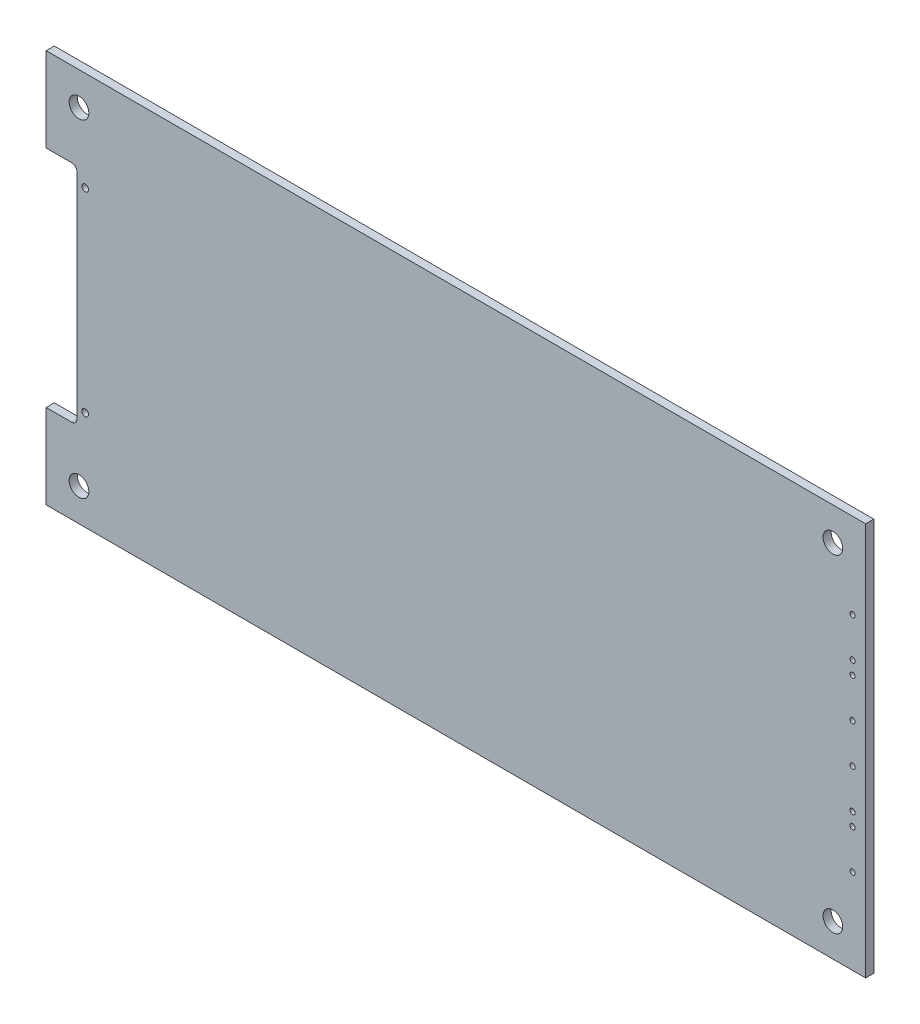
ISO-10303-21;
HEADER;
FILE_DESCRIPTION(('STEP AP214'),'2;1');
FILE_NAME('part.step','',(''),(''),'','','');
FILE_SCHEMA(('AUTOMOTIVE_DESIGN { 1 0 10303 214 1 1 1 1 }'));
ENDSEC;
DATA;
#1=APPLICATION_CONTEXT('core data for automotive mechanical design processes');
#2=APPLICATION_PROTOCOL_DEFINITION('international standard','automotive_design',2000,#1);
#3=PRODUCT_CONTEXT('',#1,'mechanical');
#4=PRODUCT('Part','Part','',(#3));
#5=PRODUCT_RELATED_PRODUCT_CATEGORY('part','',(#4));
#6=PRODUCT_DEFINITION_FORMATION('','',#4);
#7=PRODUCT_DEFINITION_CONTEXT('part definition',#1,'design');
#8=PRODUCT_DEFINITION('design','',#6,#7);
#9=PRODUCT_DEFINITION_SHAPE('','',#8);
#10=(LENGTH_UNIT() NAMED_UNIT(*) SI_UNIT(.MILLI.,.METRE.));
#11=(NAMED_UNIT(*) PLANE_ANGLE_UNIT() SI_UNIT($,.RADIAN.));
#12=(NAMED_UNIT(*) SI_UNIT($,.STERADIAN.) SOLID_ANGLE_UNIT());
#13=UNCERTAINTY_MEASURE_WITH_UNIT(LENGTH_MEASURE(1.E-05),#10,'distance_accuracy_value','');
#14=(GEOMETRIC_REPRESENTATION_CONTEXT(3) GLOBAL_UNCERTAINTY_ASSIGNED_CONTEXT((#13)) GLOBAL_UNIT_ASSIGNED_CONTEXT((#10,
#11,#12)) REPRESENTATION_CONTEXT('',''));
#15=CARTESIAN_POINT('',(0.,0.,0.));
#16=DIRECTION('',(0.,0.,1.));
#17=DIRECTION('',(1.,0.,0.));
#18=AXIS2_PLACEMENT_3D('',#15,#16,#17);
#19=CARTESIAN_POINT('',(0.,0.,1.5748));
#20=DIRECTION('',(1.,0.,0.));
#21=DIRECTION('',(0.,1.,0.));
#22=AXIS2_PLACEMENT_3D('',#19,#20,#21);
#23=PLANE('',#22);
#24=DIRECTION('',(0.,-1.,0.));
#25=VECTOR('',#24,1.);
#26=CARTESIAN_POINT('',(0.,0.,0.));
#27=LINE('',#26,#25);
#28=CARTESIAN_POINT('',(0.,0.,0.));
#29=VERTEX_POINT('',#28);
#30=CARTESIAN_POINT('',(0.,-16.335006,0.));
#31=VERTEX_POINT('',#30);
#32=EDGE_CURVE('E243',#29,#31,#27,.T.);
#33=ORIENTED_EDGE('',*,*,#32,.T.);
#34=DIRECTION('',(0.,0.,1.));
#35=VECTOR('',#34,1.);
#36=CARTESIAN_POINT('',(0.,-16.335006,0.));
#37=LINE('',#36,#35);
#38=CARTESIAN_POINT('',(0.,-16.335006,1.5748));
#39=VERTEX_POINT('',#38);
#40=EDGE_CURVE('E191',#31,#39,#37,.T.);
#41=ORIENTED_EDGE('',*,*,#40,.T.);
#42=DIRECTION('',(0.,-1.,0.));
#43=VECTOR('',#42,1.);
#44=CARTESIAN_POINT('',(0.,0.,1.5748));
#45=LINE('',#44,#43);
#46=CARTESIAN_POINT('',(0.,0.,1.5748));
#47=VERTEX_POINT('',#46);
#48=EDGE_CURVE('E133',#47,#39,#45,.T.);
#49=ORIENTED_EDGE('',*,*,#48,.F.);
#50=DIRECTION('',(0.,0.,-1.));
#51=VECTOR('',#50,1.);
#52=CARTESIAN_POINT('',(0.,0.,1.5748));
#53=LINE('',#52,#51);
#54=EDGE_CURVE('E36',#47,#29,#53,.T.);
#55=ORIENTED_EDGE('',*,*,#54,.T.);
#56=EDGE_LOOP('',(#33,#41,#49,#55));
#57=FACE_BOUND('',#56,.T.);
#58=ADVANCED_FACE('F27',(#57),#23,.F.);
#59=CARTESIAN_POINT('',(158.75,0.,1.5748));
#60=DIRECTION('',(-1.,0.,0.));
#61=DIRECTION('',(0.,0.,1.));
#62=AXIS2_PLACEMENT_3D('',#59,#60,#61);
#63=PLANE('',#62);
#64=DIRECTION('',(0.,1.,0.));
#65=VECTOR('',#64,1.);
#66=CARTESIAN_POINT('',(158.75,0.,0.));
#67=LINE('',#66,#65);
#68=CARTESIAN_POINT('',(158.75,-76.2,0.));
#69=VERTEX_POINT('',#68);
#70=CARTESIAN_POINT('',(158.75,0.,0.));
#71=VERTEX_POINT('',#70);
#72=EDGE_CURVE('E237',#69,#71,#67,.T.);
#73=ORIENTED_EDGE('',*,*,#72,.T.);
#74=DIRECTION('',(0.,0.,-1.));
#75=VECTOR('',#74,1.);
#76=CARTESIAN_POINT('',(158.75,0.,1.5748));
#77=LINE('',#76,#75);
#78=CARTESIAN_POINT('',(158.75,0.,1.5748));
#79=VERTEX_POINT('',#78);
#80=EDGE_CURVE('E11',#79,#71,#77,.T.);
#81=ORIENTED_EDGE('',*,*,#80,.F.);
#82=DIRECTION('',(0.,1.,0.));
#83=VECTOR('',#82,1.);
#84=CARTESIAN_POINT('',(158.75,0.,1.5748));
#85=LINE('',#84,#83);
#86=CARTESIAN_POINT('',(158.75,-76.2,1.5748));
#87=VERTEX_POINT('',#86);
#88=EDGE_CURVE('E137',#87,#79,#85,.T.);
#89=ORIENTED_EDGE('',*,*,#88,.F.);
#90=DIRECTION('',(0.,0.,-1.));
#91=VECTOR('',#90,1.);
#92=CARTESIAN_POINT('',(158.75,-76.2,1.5748));
#93=LINE('',#92,#91);
#94=EDGE_CURVE('E142',#87,#69,#93,.T.);
#95=ORIENTED_EDGE('',*,*,#94,.T.);
#96=EDGE_LOOP('',(#73,#81,#89,#95));
#97=FACE_BOUND('',#96,.T.);
#98=ADVANCED_FACE('F29',(#97),#63,.F.);
#99=CARTESIAN_POINT('',(0.,0.,1.5748));
#100=DIRECTION('',(0.,-1.,0.));
#101=DIRECTION('',(0.,0.,-1.));
#102=AXIS2_PLACEMENT_3D('',#99,#100,#101);
#103=PLANE('',#102);
#104=DIRECTION('',(-1.,0.,0.));
#105=VECTOR('',#104,1.);
#106=CARTESIAN_POINT('',(0.,0.,0.));
#107=LINE('',#106,#105);
#108=EDGE_CURVE('E240',#71,#29,#107,.T.);
#109=ORIENTED_EDGE('',*,*,#108,.T.);
#110=ORIENTED_EDGE('',*,*,#54,.F.);
#111=DIRECTION('',(-1.,0.,0.));
#112=VECTOR('',#111,1.);
#113=CARTESIAN_POINT('',(0.,0.,1.5748));
#114=LINE('',#113,#112);
#115=EDGE_CURVE('E134',#79,#47,#114,.T.);
#116=ORIENTED_EDGE('',*,*,#115,.F.);
#117=ORIENTED_EDGE('',*,*,#80,.T.);
#118=EDGE_LOOP('',(#109,#110,#116,#117));
#119=FACE_BOUND('',#118,.T.);
#120=ADVANCED_FACE('F253',(#119),#103,.F.);
#121=CARTESIAN_POINT('',(0.,-59.865006,1.5748));
#122=VERTEX_POINT('',#121);
#123=CARTESIAN_POINT('',(0.,-76.2,1.5748));
#124=VERTEX_POINT('',#123);
#125=EDGE_CURVE('E123',#122,#124,#45,.T.);
#126=ORIENTED_EDGE('',*,*,#125,.F.);
#127=DIRECTION('',(0.,0.,1.));
#128=VECTOR('',#127,1.);
#129=CARTESIAN_POINT('',(0.,-59.865006,0.));
#130=LINE('',#129,#128);
#131=CARTESIAN_POINT('',(0.,-59.865006,0.));
#132=VERTEX_POINT('',#131);
#133=EDGE_CURVE('E107',#132,#122,#130,.T.);
#134=ORIENTED_EDGE('',*,*,#133,.F.);
#135=CARTESIAN_POINT('',(0.,-76.2,0.));
#136=VERTEX_POINT('',#135);
#137=EDGE_CURVE('E242',#132,#136,#27,.T.);
#138=ORIENTED_EDGE('',*,*,#137,.T.);
#139=DIRECTION('',(0.,0.,-1.));
#140=VECTOR('',#139,1.);
#141=CARTESIAN_POINT('',(0.,-76.2,1.5748));
#142=LINE('',#141,#140);
#143=EDGE_CURVE('E132',#124,#136,#142,.T.);
#144=ORIENTED_EDGE('',*,*,#143,.F.);
#145=EDGE_LOOP('',(#126,#134,#138,#144));
#146=FACE_BOUND('',#145,.T.);
#147=ADVANCED_FACE('F130',(#146),#23,.F.);
#148=CARTESIAN_POINT('',(0.,-76.2,1.5748));
#149=DIRECTION('',(0.,1.,0.));
#150=DIRECTION('',(0.,0.,1.));
#151=AXIS2_PLACEMENT_3D('',#148,#149,#150);
#152=PLANE('',#151);
#153=DIRECTION('',(1.,0.,0.));
#154=VECTOR('',#153,1.);
#155=CARTESIAN_POINT('',(0.,-76.2,0.));
#156=LINE('',#155,#154);
#157=EDGE_CURVE('E246',#136,#69,#156,.T.);
#158=ORIENTED_EDGE('',*,*,#157,.T.);
#159=ORIENTED_EDGE('',*,*,#94,.F.);
#160=DIRECTION('',(1.,0.,0.));
#161=VECTOR('',#160,1.);
#162=CARTESIAN_POINT('',(0.,-76.2,1.5748));
#163=LINE('',#162,#161);
#164=EDGE_CURVE('E52',#124,#87,#163,.T.);
#165=ORIENTED_EDGE('',*,*,#164,.F.);
#166=ORIENTED_EDGE('',*,*,#143,.T.);
#167=EDGE_LOOP('',(#158,#159,#165,#166));
#168=FACE_BOUND('',#167,.T.);
#169=ADVANCED_FACE('F272',(#168),#152,.F.);
#170=CARTESIAN_POINT('',(158.75,-76.2,1.5748));
#171=DIRECTION('',(0.,0.,1.));
#172=DIRECTION('',(1.,0.,0.));
#173=AXIS2_PLACEMENT_3D('',#170,#171,#172);
#174=PLANE('',#173);
#175=CARTESIAN_POINT('',(156.21,-24.13,1.5748));
#176=DIRECTION('',(0.,0.,1.));
#177=DIRECTION('',(1.,0.,0.));
#178=AXIS2_PLACEMENT_3D('',#175,#176,#177);
#179=CIRCLE('',#178,0.508000000000003);
#180=CARTESIAN_POINT('',(156.718,-24.13,1.5748));
#181=VERTEX_POINT('',#180);
#182=EDGE_CURVE('E458',#181,#181,#179,.T.);
#183=ORIENTED_EDGE('',*,*,#182,.F.);
#184=EDGE_LOOP('',(#183));
#185=FACE_BOUND('',#184,.T.);
#186=CARTESIAN_POINT('',(156.21,-26.67,1.5748));
#187=DIRECTION('',(0.,0.,1.));
#188=DIRECTION('',(1.,0.,0.));
#189=AXIS2_PLACEMENT_3D('',#186,#187,#188);
#190=CIRCLE('',#189,0.508000000000003);
#191=CARTESIAN_POINT('',(156.718,-26.67,1.5748));
#192=VERTEX_POINT('',#191);
#193=EDGE_CURVE('E462',#192,#192,#190,.T.);
#194=ORIENTED_EDGE('',*,*,#193,.F.);
#195=EDGE_LOOP('',(#194));
#196=FACE_BOUND('',#195,.T.);
#197=CARTESIAN_POINT('',(156.21,-34.29,1.5748));
#198=DIRECTION('',(0.,0.,1.));
#199=DIRECTION('',(1.,0.,0.));
#200=AXIS2_PLACEMENT_3D('',#197,#198,#199);
#201=CIRCLE('',#200,0.508000000000003);
#202=CARTESIAN_POINT('',(156.718,-34.29,1.5748));
#203=VERTEX_POINT('',#202);
#204=EDGE_CURVE('E471',#203,#203,#201,.T.);
#205=ORIENTED_EDGE('',*,*,#204,.F.);
#206=EDGE_LOOP('',(#205));
#207=FACE_BOUND('',#206,.T.);
#208=CARTESIAN_POINT('',(156.21,-16.51,1.5748));
#209=DIRECTION('',(0.,0.,1.));
#210=DIRECTION('',(1.,0.,0.));
#211=AXIS2_PLACEMENT_3D('',#208,#209,#210);
#212=CIRCLE('',#211,0.508000000000003);
#213=CARTESIAN_POINT('',(156.718,-16.51,1.5748));
#214=VERTEX_POINT('',#213);
#215=EDGE_CURVE('E477',#214,#214,#212,.T.);
#216=ORIENTED_EDGE('',*,*,#215,.F.);
#217=EDGE_LOOP('',(#216));
#218=FACE_BOUND('',#217,.T.);
#219=CARTESIAN_POINT('',(156.21,-41.91,1.5748));
#220=DIRECTION('',(0.,0.,1.));
#221=DIRECTION('',(1.,0.,0.));
#222=AXIS2_PLACEMENT_3D('',#219,#220,#221);
#223=CIRCLE('',#222,0.508000000000003);
#224=CARTESIAN_POINT('',(156.718,-41.91,1.5748));
#225=VERTEX_POINT('',#224);
#226=EDGE_CURVE('E166',#225,#225,#223,.T.);
#227=ORIENTED_EDGE('',*,*,#226,.F.);
#228=EDGE_LOOP('',(#227));
#229=FACE_BOUND('',#228,.T.);
#230=CARTESIAN_POINT('',(156.21,-49.53,1.5748));
#231=DIRECTION('',(0.,0.,1.));
#232=DIRECTION('',(1.,0.,0.));
#233=AXIS2_PLACEMENT_3D('',#230,#231,#232);
#234=CIRCLE('',#233,0.508000000000003);
#235=CARTESIAN_POINT('',(156.718,-49.53,1.5748));
#236=VERTEX_POINT('',#235);
#237=EDGE_CURVE('E156',#236,#236,#234,.T.);
#238=ORIENTED_EDGE('',*,*,#237,.F.);
#239=EDGE_LOOP('',(#238));
#240=FACE_BOUND('',#239,.T.);
#241=CARTESIAN_POINT('',(156.21,-52.07,1.5748));
#242=DIRECTION('',(0.,0.,1.));
#243=DIRECTION('',(1.,0.,0.));
#244=AXIS2_PLACEMENT_3D('',#241,#242,#243);
#245=CIRCLE('',#244,0.508000000000003);
#246=CARTESIAN_POINT('',(156.718,-52.07,1.5748));
#247=VERTEX_POINT('',#246);
#248=EDGE_CURVE('E153',#247,#247,#245,.T.);
#249=ORIENTED_EDGE('',*,*,#248,.F.);
#250=EDGE_LOOP('',(#249));
#251=FACE_BOUND('',#250,.T.);
#252=CARTESIAN_POINT('',(156.21,-59.69,1.5748));
#253=DIRECTION('',(0.,0.,1.));
#254=DIRECTION('',(1.,0.,0.));
#255=AXIS2_PLACEMENT_3D('',#252,#253,#254);
#256=CIRCLE('',#255,0.508000000000003);
#257=CARTESIAN_POINT('',(156.718,-59.69,1.5748));
#258=VERTEX_POINT('',#257);
#259=EDGE_CURVE('E150',#258,#258,#256,.T.);
#260=ORIENTED_EDGE('',*,*,#259,.F.);
#261=EDGE_LOOP('',(#260));
#262=FACE_BOUND('',#261,.T.);
#263=DIRECTION('',(-1.,0.,0.));
#264=VECTOR('',#263,1.);
#265=CARTESIAN_POINT('',(0.,-16.335006,1.5748));
#266=LINE('',#265,#264);
#267=CARTESIAN_POINT('',(4.95,-16.335006,1.5748));
#268=VERTEX_POINT('',#267);
#269=EDGE_CURVE('E179',#268,#39,#266,.T.);
#270=ORIENTED_EDGE('',*,*,#269,.F.);
#271=CARTESIAN_POINT('',(4.95,-17.335006,1.5748));
#272=DIRECTION('',(0.,0.,1.));
#273=DIRECTION('',(-1.,0.,0.));
#274=AXIS2_PLACEMENT_3D('',#271,#272,#273);
#275=CIRCLE('',#274,1.);
#276=CARTESIAN_POINT('',(5.95000000000001,-17.335006,1.5748));
#277=VERTEX_POINT('',#276);
#278=EDGE_CURVE('E176',#277,#268,#275,.T.);
#279=ORIENTED_EDGE('',*,*,#278,.F.);
#280=DIRECTION('',(0.,1.,0.));
#281=VECTOR('',#280,1.);
#282=CARTESIAN_POINT('',(5.95,-58.865006,1.5748));
#283=LINE('',#282,#281);
#284=CARTESIAN_POINT('',(5.95,-58.865006,1.5748));
#285=VERTEX_POINT('',#284);
#286=EDGE_CURVE('E173',#285,#277,#283,.T.);
#287=ORIENTED_EDGE('',*,*,#286,.F.);
#288=CARTESIAN_POINT('',(4.95,-58.865006,1.5748));
#289=DIRECTION('',(0.,0.,1.));
#290=DIRECTION('',(-1.,0.,0.));
#291=AXIS2_PLACEMENT_3D('',#288,#289,#290);
#292=CIRCLE('',#291,1.);
#293=CARTESIAN_POINT('',(4.95,-59.865006,1.5748));
#294=VERTEX_POINT('',#293);
#295=EDGE_CURVE('E127',#294,#285,#292,.T.);
#296=ORIENTED_EDGE('',*,*,#295,.F.);
#297=DIRECTION('',(1.,0.,0.));
#298=VECTOR('',#297,1.);
#299=CARTESIAN_POINT('',(0.,-59.865006,1.5748));
#300=LINE('',#299,#298);
#301=EDGE_CURVE('E110',#122,#294,#300,.T.);
#302=ORIENTED_EDGE('',*,*,#301,.F.);
#303=ORIENTED_EDGE('',*,*,#125,.T.);
#304=ORIENTED_EDGE('',*,*,#164,.T.);
#305=ORIENTED_EDGE('',*,*,#88,.T.);
#306=ORIENTED_EDGE('',*,*,#115,.T.);
#307=ORIENTED_EDGE('',*,*,#48,.T.);
#308=EDGE_LOOP('',(#270,#279,#287,#296,#302,#303,#304,#305,#306,#307));
#309=FACE_BOUND('',#308,.T.);
#310=CARTESIAN_POINT('',(7.55,-56.965088,1.5748));
#311=DIRECTION('',(0.,0.,1.));
#312=DIRECTION('',(1.,0.,0.));
#313=AXIS2_PLACEMENT_3D('',#310,#311,#312);
#314=CIRCLE('',#313,0.649999999999997);
#315=CARTESIAN_POINT('',(8.2,-56.965088,1.5748));
#316=VERTEX_POINT('',#315);
#317=EDGE_CURVE('E194',#316,#316,#314,.T.);
#318=ORIENTED_EDGE('',*,*,#317,.F.);
#319=EDGE_LOOP('',(#318));
#320=FACE_BOUND('',#319,.T.);
#321=CARTESIAN_POINT('',(7.55,-19.234912,1.5748));
#322=DIRECTION('',(0.,0.,1.));
#323=DIRECTION('',(1.,0.,0.));
#324=AXIS2_PLACEMENT_3D('',#321,#322,#323);
#325=CIRCLE('',#324,0.649999999999999);
#326=CARTESIAN_POINT('',(8.2,-19.234912,1.5748));
#327=VERTEX_POINT('',#326);
#328=EDGE_CURVE('E207',#327,#327,#325,.T.);
#329=ORIENTED_EDGE('',*,*,#328,.F.);
#330=EDGE_LOOP('',(#329));
#331=FACE_BOUND('',#330,.T.);
#332=CARTESIAN_POINT('',(6.35,-69.85,1.5748));
#333=DIRECTION('',(0.,0.,1.));
#334=DIRECTION('',(1.,0.,0.));
#335=AXIS2_PLACEMENT_3D('',#332,#333,#334);
#336=CIRCLE('',#335,1.905);
#337=CARTESIAN_POINT('',(8.255,-69.85,1.5748));
#338=VERTEX_POINT('',#337);
#339=EDGE_CURVE('E213',#338,#338,#336,.T.);
#340=ORIENTED_EDGE('',*,*,#339,.F.);
#341=EDGE_LOOP('',(#340));
#342=FACE_BOUND('',#341,.T.);
#343=CARTESIAN_POINT('',(152.4,-69.85,1.5748));
#344=DIRECTION('',(0.,0.,1.));
#345=DIRECTION('',(1.,0.,0.));
#346=AXIS2_PLACEMENT_3D('',#343,#344,#345);
#347=CIRCLE('',#346,1.90499999999999);
#348=CARTESIAN_POINT('',(154.305,-69.85,1.5748));
#349=VERTEX_POINT('',#348);
#350=EDGE_CURVE('E219',#349,#349,#347,.T.);
#351=ORIENTED_EDGE('',*,*,#350,.F.);
#352=EDGE_LOOP('',(#351));
#353=FACE_BOUND('',#352,.T.);
#354=CARTESIAN_POINT('',(6.34999999999999,-6.35,1.5748));
#355=DIRECTION('',(0.,0.,1.));
#356=DIRECTION('',(1.,0.,0.));
#357=AXIS2_PLACEMENT_3D('',#354,#355,#356);
#358=CIRCLE('',#357,1.905);
#359=CARTESIAN_POINT('',(8.255,-6.35,1.5748));
#360=VERTEX_POINT('',#359);
#361=EDGE_CURVE('E225',#360,#360,#358,.T.);
#362=ORIENTED_EDGE('',*,*,#361,.F.);
#363=EDGE_LOOP('',(#362));
#364=FACE_BOUND('',#363,.T.);
#365=CARTESIAN_POINT('',(152.4,-6.34999999999999,1.5748));
#366=DIRECTION('',(0.,0.,1.));
#367=DIRECTION('',(1.,0.,0.));
#368=AXIS2_PLACEMENT_3D('',#365,#366,#367);
#369=CIRCLE('',#368,1.90499999999999);
#370=CARTESIAN_POINT('',(154.305,-6.34999999999999,1.5748));
#371=VERTEX_POINT('',#370);
#372=EDGE_CURVE('E231',#371,#371,#369,.T.);
#373=ORIENTED_EDGE('',*,*,#372,.F.);
#374=EDGE_LOOP('',(#373));
#375=FACE_BOUND('',#374,.T.);
#376=ADVANCED_FACE('F121',(#185,#196,#207,#218,#229,#240,#251,#262,#309,#320,#331,#342,#353,
#364,#375),#174,.T.);
#377=CARTESIAN_POINT('',(158.75,-76.2,0.));
#378=DIRECTION('',(0.,0.,1.));
#379=DIRECTION('',(1.,0.,0.));
#380=AXIS2_PLACEMENT_3D('',#377,#378,#379);
#381=PLANE('',#380);
#382=CARTESIAN_POINT('',(156.21,-24.13,0.));
#383=DIRECTION('',(0.,0.,1.));
#384=DIRECTION('',(1.,0.,0.));
#385=AXIS2_PLACEMENT_3D('',#382,#383,#384);
#386=CIRCLE('',#385,0.508000000000003);
#387=CARTESIAN_POINT('',(156.718,-24.13,0.));
#388=VERTEX_POINT('',#387);
#389=EDGE_CURVE('E461',#388,#388,#386,.T.);
#390=ORIENTED_EDGE('',*,*,#389,.T.);
#391=EDGE_LOOP('',(#390));
#392=FACE_BOUND('',#391,.T.);
#393=CARTESIAN_POINT('',(156.21,-26.67,0.));
#394=DIRECTION('',(0.,0.,1.));
#395=DIRECTION('',(1.,0.,0.));
#396=AXIS2_PLACEMENT_3D('',#393,#394,#395);
#397=CIRCLE('',#396,0.508000000000003);
#398=CARTESIAN_POINT('',(156.718,-26.67,0.));
#399=VERTEX_POINT('',#398);
#400=EDGE_CURVE('E465',#399,#399,#397,.T.);
#401=ORIENTED_EDGE('',*,*,#400,.T.);
#402=EDGE_LOOP('',(#401));
#403=FACE_BOUND('',#402,.T.);
#404=CARTESIAN_POINT('',(156.21,-34.29,0.));
#405=DIRECTION('',(0.,0.,1.));
#406=DIRECTION('',(1.,0.,0.));
#407=AXIS2_PLACEMENT_3D('',#404,#405,#406);
#408=CIRCLE('',#407,0.508000000000003);
#409=CARTESIAN_POINT('',(156.718,-34.29,0.));
#410=VERTEX_POINT('',#409);
#411=EDGE_CURVE('E474',#410,#410,#408,.T.);
#412=ORIENTED_EDGE('',*,*,#411,.T.);
#413=EDGE_LOOP('',(#412));
#414=FACE_BOUND('',#413,.T.);
#415=CARTESIAN_POINT('',(156.21,-16.51,0.));
#416=DIRECTION('',(0.,0.,1.));
#417=DIRECTION('',(1.,0.,0.));
#418=AXIS2_PLACEMENT_3D('',#415,#416,#417);
#419=CIRCLE('',#418,0.508000000000003);
#420=CARTESIAN_POINT('',(156.718,-16.51,0.));
#421=VERTEX_POINT('',#420);
#422=EDGE_CURVE('E479',#421,#421,#419,.T.);
#423=ORIENTED_EDGE('',*,*,#422,.T.);
#424=EDGE_LOOP('',(#423));
#425=FACE_BOUND('',#424,.T.);
#426=CARTESIAN_POINT('',(156.21,-41.91,0.));
#427=DIRECTION('',(0.,0.,1.));
#428=DIRECTION('',(1.,0.,0.));
#429=AXIS2_PLACEMENT_3D('',#426,#427,#428);
#430=CIRCLE('',#429,0.508000000000003);
#431=CARTESIAN_POINT('',(156.718,-41.91,0.));
#432=VERTEX_POINT('',#431);
#433=EDGE_CURVE('E31',#432,#432,#430,.T.);
#434=ORIENTED_EDGE('',*,*,#433,.T.);
#435=EDGE_LOOP('',(#434));
#436=FACE_BOUND('',#435,.T.);
#437=CARTESIAN_POINT('',(156.21,-49.53,0.));
#438=DIRECTION('',(0.,0.,1.));
#439=DIRECTION('',(1.,0.,0.));
#440=AXIS2_PLACEMENT_3D('',#437,#438,#439);
#441=CIRCLE('',#440,0.508000000000003);
#442=CARTESIAN_POINT('',(156.718,-49.53,0.));
#443=VERTEX_POINT('',#442);
#444=EDGE_CURVE('E154',#443,#443,#441,.T.);
#445=ORIENTED_EDGE('',*,*,#444,.T.);
#446=EDGE_LOOP('',(#445));
#447=FACE_BOUND('',#446,.T.);
#448=CARTESIAN_POINT('',(156.21,-52.07,0.));
#449=DIRECTION('',(0.,0.,1.));
#450=DIRECTION('',(1.,0.,0.));
#451=AXIS2_PLACEMENT_3D('',#448,#449,#450);
#452=CIRCLE('',#451,0.508000000000003);
#453=CARTESIAN_POINT('',(156.718,-52.07,0.));
#454=VERTEX_POINT('',#453);
#455=EDGE_CURVE('E151',#454,#454,#452,.T.);
#456=ORIENTED_EDGE('',*,*,#455,.T.);
#457=EDGE_LOOP('',(#456));
#458=FACE_BOUND('',#457,.T.);
#459=CARTESIAN_POINT('',(156.21,-59.69,0.));
#460=DIRECTION('',(0.,0.,1.));
#461=DIRECTION('',(1.,0.,0.));
#462=AXIS2_PLACEMENT_3D('',#459,#460,#461);
#463=CIRCLE('',#462,0.508000000000003);
#464=CARTESIAN_POINT('',(156.718,-59.69,0.));
#465=VERTEX_POINT('',#464);
#466=EDGE_CURVE('E128',#465,#465,#463,.T.);
#467=ORIENTED_EDGE('',*,*,#466,.T.);
#468=EDGE_LOOP('',(#467));
#469=FACE_BOUND('',#468,.T.);
#470=CARTESIAN_POINT('',(7.55,-56.965088,0.));
#471=DIRECTION('',(0.,0.,1.));
#472=DIRECTION('',(1.,0.,0.));
#473=AXIS2_PLACEMENT_3D('',#470,#471,#472);
#474=CIRCLE('',#473,0.649999999999997);
#475=CARTESIAN_POINT('',(8.2,-56.965088,0.));
#476=VERTEX_POINT('',#475);
#477=EDGE_CURVE('E204',#476,#476,#474,.T.);
#478=ORIENTED_EDGE('',*,*,#477,.T.);
#479=EDGE_LOOP('',(#478));
#480=FACE_BOUND('',#479,.T.);
#481=CARTESIAN_POINT('',(7.55,-19.234912,0.));
#482=DIRECTION('',(0.,0.,1.));
#483=DIRECTION('',(1.,0.,0.));
#484=AXIS2_PLACEMENT_3D('',#481,#482,#483);
#485=CIRCLE('',#484,0.649999999999999);
#486=CARTESIAN_POINT('',(8.2,-19.234912,0.));
#487=VERTEX_POINT('',#486);
#488=EDGE_CURVE('E210',#487,#487,#485,.T.);
#489=ORIENTED_EDGE('',*,*,#488,.T.);
#490=EDGE_LOOP('',(#489));
#491=FACE_BOUND('',#490,.T.);
#492=CARTESIAN_POINT('',(6.35,-69.85,0.));
#493=DIRECTION('',(0.,0.,1.));
#494=DIRECTION('',(1.,0.,0.));
#495=AXIS2_PLACEMENT_3D('',#492,#493,#494);
#496=CIRCLE('',#495,1.905);
#497=CARTESIAN_POINT('',(8.255,-69.85,0.));
#498=VERTEX_POINT('',#497);
#499=EDGE_CURVE('E216',#498,#498,#496,.T.);
#500=ORIENTED_EDGE('',*,*,#499,.T.);
#501=EDGE_LOOP('',(#500));
#502=FACE_BOUND('',#501,.T.);
#503=CARTESIAN_POINT('',(152.4,-69.85,0.));
#504=DIRECTION('',(0.,0.,1.));
#505=DIRECTION('',(1.,0.,0.));
#506=AXIS2_PLACEMENT_3D('',#503,#504,#505);
#507=CIRCLE('',#506,1.90499999999999);
#508=CARTESIAN_POINT('',(154.305,-69.85,0.));
#509=VERTEX_POINT('',#508);
#510=EDGE_CURVE('E222',#509,#509,#507,.T.);
#511=ORIENTED_EDGE('',*,*,#510,.T.);
#512=EDGE_LOOP('',(#511));
#513=FACE_BOUND('',#512,.T.);
#514=CARTESIAN_POINT('',(6.34999999999999,-6.35,0.));
#515=DIRECTION('',(0.,0.,1.));
#516=DIRECTION('',(1.,0.,0.));
#517=AXIS2_PLACEMENT_3D('',#514,#515,#516);
#518=CIRCLE('',#517,1.905);
#519=CARTESIAN_POINT('',(8.255,-6.35,0.));
#520=VERTEX_POINT('',#519);
#521=EDGE_CURVE('E228',#520,#520,#518,.T.);
#522=ORIENTED_EDGE('',*,*,#521,.T.);
#523=EDGE_LOOP('',(#522));
#524=FACE_BOUND('',#523,.T.);
#525=CARTESIAN_POINT('',(152.4,-6.34999999999999,0.));
#526=DIRECTION('',(0.,0.,1.));
#527=DIRECTION('',(1.,0.,0.));
#528=AXIS2_PLACEMENT_3D('',#525,#526,#527);
#529=CIRCLE('',#528,1.90499999999999);
#530=CARTESIAN_POINT('',(154.305,-6.34999999999999,0.));
#531=VERTEX_POINT('',#530);
#532=EDGE_CURVE('E234',#531,#531,#529,.T.);
#533=ORIENTED_EDGE('',*,*,#532,.T.);
#534=EDGE_LOOP('',(#533));
#535=FACE_BOUND('',#534,.T.);
#536=CARTESIAN_POINT('',(4.95,-17.335006,0.));
#537=DIRECTION('',(0.,0.,1.));
#538=DIRECTION('',(-1.,0.,0.));
#539=AXIS2_PLACEMENT_3D('',#536,#537,#538);
#540=CIRCLE('',#539,1.);
#541=CARTESIAN_POINT('',(5.95000000000001,-17.335006,0.));
#542=VERTEX_POINT('',#541);
#543=CARTESIAN_POINT('',(4.95,-16.335006,0.));
#544=VERTEX_POINT('',#543);
#545=EDGE_CURVE('E186',#542,#544,#540,.T.);
#546=ORIENTED_EDGE('',*,*,#545,.T.);
#547=DIRECTION('',(-1.,0.,0.));
#548=VECTOR('',#547,1.);
#549=CARTESIAN_POINT('',(0.,-16.335006,0.));
#550=LINE('',#549,#548);
#551=EDGE_CURVE('E118',#544,#31,#550,.T.);
#552=ORIENTED_EDGE('',*,*,#551,.T.);
#553=ORIENTED_EDGE('',*,*,#32,.F.);
#554=ORIENTED_EDGE('',*,*,#108,.F.);
#555=ORIENTED_EDGE('',*,*,#72,.F.);
#556=ORIENTED_EDGE('',*,*,#157,.F.);
#557=ORIENTED_EDGE('',*,*,#137,.F.);
#558=DIRECTION('',(1.,0.,0.));
#559=VECTOR('',#558,1.);
#560=CARTESIAN_POINT('',(0.,-59.865006,0.));
#561=LINE('',#560,#559);
#562=CARTESIAN_POINT('',(4.95000000000001,-59.865006,0.));
#563=VERTEX_POINT('',#562);
#564=EDGE_CURVE('E113',#132,#563,#561,.T.);
#565=ORIENTED_EDGE('',*,*,#564,.T.);
#566=CARTESIAN_POINT('',(4.95,-58.865006,0.));
#567=DIRECTION('',(0.,0.,1.));
#568=DIRECTION('',(-1.,0.,0.));
#569=AXIS2_PLACEMENT_3D('',#566,#567,#568);
#570=CIRCLE('',#569,1.);
#571=CARTESIAN_POINT('',(5.95,-58.865006,0.));
#572=VERTEX_POINT('',#571);
#573=EDGE_CURVE('E44',#563,#572,#570,.T.);
#574=ORIENTED_EDGE('',*,*,#573,.T.);
#575=DIRECTION('',(0.,1.,0.));
#576=VECTOR('',#575,1.);
#577=CARTESIAN_POINT('',(5.95,-58.865006,0.));
#578=LINE('',#577,#576);
#579=EDGE_CURVE('E183',#572,#542,#578,.T.);
#580=ORIENTED_EDGE('',*,*,#579,.T.);
#581=EDGE_LOOP('',(#546,#552,#553,#554,#555,#556,#557,#565,#574,#580));
#582=FACE_BOUND('',#581,.T.);
#583=ADVANCED_FACE('F269',(#392,#403,#414,#425,#436,#447,#458,#469,#480,#491,#502,#513,#524,
#535,#582),#381,.F.);
#584=CARTESIAN_POINT('',(152.4,-6.34999999999999,0.));
#585=DIRECTION('',(0.,0.,1.));
#586=DIRECTION('',(1.,0.,0.));
#587=AXIS2_PLACEMENT_3D('',#584,#585,#586);
#588=CYLINDRICAL_SURFACE('',#587,1.90499999999999);
#589=ORIENTED_EDGE('',*,*,#532,.F.);
#590=EDGE_LOOP('',(#589));
#591=FACE_BOUND('',#590,.T.);
#592=ORIENTED_EDGE('',*,*,#372,.T.);
#593=EDGE_LOOP('',(#592));
#594=FACE_BOUND('',#593,.T.);
#595=ADVANCED_FACE('F314',(#591,#594),#588,.F.);
#596=CARTESIAN_POINT('',(6.34999999999999,-6.35,0.));
#597=DIRECTION('',(0.,0.,1.));
#598=DIRECTION('',(1.,0.,0.));
#599=AXIS2_PLACEMENT_3D('',#596,#597,#598);
#600=CYLINDRICAL_SURFACE('',#599,1.905);
#601=ORIENTED_EDGE('',*,*,#521,.F.);
#602=EDGE_LOOP('',(#601));
#603=FACE_BOUND('',#602,.T.);
#604=ORIENTED_EDGE('',*,*,#361,.T.);
#605=EDGE_LOOP('',(#604));
#606=FACE_BOUND('',#605,.T.);
#607=ADVANCED_FACE('F322',(#603,#606),#600,.F.);
#608=CARTESIAN_POINT('',(152.4,-69.85,0.));
#609=DIRECTION('',(0.,0.,1.));
#610=DIRECTION('',(1.,0.,0.));
#611=AXIS2_PLACEMENT_3D('',#608,#609,#610);
#612=CYLINDRICAL_SURFACE('',#611,1.90499999999999);
#613=ORIENTED_EDGE('',*,*,#510,.F.);
#614=EDGE_LOOP('',(#613));
#615=FACE_BOUND('',#614,.T.);
#616=ORIENTED_EDGE('',*,*,#350,.T.);
#617=EDGE_LOOP('',(#616));
#618=FACE_BOUND('',#617,.T.);
#619=ADVANCED_FACE('F330',(#615,#618),#612,.F.);
#620=CARTESIAN_POINT('',(6.35,-69.85,0.));
#621=DIRECTION('',(0.,0.,1.));
#622=DIRECTION('',(1.,0.,0.));
#623=AXIS2_PLACEMENT_3D('',#620,#621,#622);
#624=CYLINDRICAL_SURFACE('',#623,1.905);
#625=ORIENTED_EDGE('',*,*,#499,.F.);
#626=EDGE_LOOP('',(#625));
#627=FACE_BOUND('',#626,.T.);
#628=ORIENTED_EDGE('',*,*,#339,.T.);
#629=EDGE_LOOP('',(#628));
#630=FACE_BOUND('',#629,.T.);
#631=ADVANCED_FACE('F338',(#627,#630),#624,.F.);
#632=CARTESIAN_POINT('',(7.55,-19.234912,0.));
#633=DIRECTION('',(0.,0.,1.));
#634=DIRECTION('',(1.,0.,0.));
#635=AXIS2_PLACEMENT_3D('',#632,#633,#634);
#636=CYLINDRICAL_SURFACE('',#635,0.649999999999999);
#637=ORIENTED_EDGE('',*,*,#488,.F.);
#638=EDGE_LOOP('',(#637));
#639=FACE_BOUND('',#638,.T.);
#640=ORIENTED_EDGE('',*,*,#328,.T.);
#641=EDGE_LOOP('',(#640));
#642=FACE_BOUND('',#641,.T.);
#643=ADVANCED_FACE('F344',(#639,#642),#636,.F.);
#644=CARTESIAN_POINT('',(7.55,-56.965088,0.));
#645=DIRECTION('',(0.,0.,1.));
#646=DIRECTION('',(1.,0.,0.));
#647=AXIS2_PLACEMENT_3D('',#644,#645,#646);
#648=CYLINDRICAL_SURFACE('',#647,0.649999999999997);
#649=ORIENTED_EDGE('',*,*,#477,.F.);
#650=EDGE_LOOP('',(#649));
#651=FACE_BOUND('',#650,.T.);
#652=ORIENTED_EDGE('',*,*,#317,.T.);
#653=EDGE_LOOP('',(#652));
#654=FACE_BOUND('',#653,.T.);
#655=ADVANCED_FACE('F354',(#651,#654),#648,.F.);
#656=CARTESIAN_POINT('',(0.,-16.335006,0.));
#657=DIRECTION('',(0.,1.,0.));
#658=DIRECTION('',(0.,0.,1.));
#659=AXIS2_PLACEMENT_3D('',#656,#657,#658);
#660=PLANE('',#659);
#661=ORIENTED_EDGE('',*,*,#269,.T.);
#662=ORIENTED_EDGE('',*,*,#40,.F.);
#663=ORIENTED_EDGE('',*,*,#551,.F.);
#664=DIRECTION('',(0.,0.,1.));
#665=VECTOR('',#664,1.);
#666=CARTESIAN_POINT('',(4.95,-16.335006,0.));
#667=LINE('',#666,#665);
#668=EDGE_CURVE('E195',#544,#268,#667,.T.);
#669=ORIENTED_EDGE('',*,*,#668,.T.);
#670=EDGE_LOOP('',(#661,#662,#663,#669));
#671=FACE_BOUND('',#670,.T.);
#672=ADVANCED_FACE('F259',(#671),#660,.F.);
#673=CARTESIAN_POINT('',(4.95,-17.335006,0.));
#674=DIRECTION('',(0.,0.,1.));
#675=DIRECTION('',(1.,0.,0.));
#676=AXIS2_PLACEMENT_3D('',#673,#674,#675);
#677=CYLINDRICAL_SURFACE('',#676,1.);
#678=ORIENTED_EDGE('',*,*,#278,.T.);
#679=ORIENTED_EDGE('',*,*,#668,.F.);
#680=ORIENTED_EDGE('',*,*,#545,.F.);
#681=DIRECTION('',(0.,0.,1.));
#682=VECTOR('',#681,1.);
#683=CARTESIAN_POINT('',(5.95000000000001,-17.335006,0.));
#684=LINE('',#683,#682);
#685=EDGE_CURVE('E197',#542,#277,#684,.T.);
#686=ORIENTED_EDGE('',*,*,#685,.T.);
#687=EDGE_LOOP('',(#678,#679,#680,#686));
#688=FACE_BOUND('',#687,.T.);
#689=ADVANCED_FACE('F263',(#688),#677,.F.);
#690=CARTESIAN_POINT('',(5.95,-58.865006,0.));
#691=DIRECTION('',(1.,0.,0.));
#692=DIRECTION('',(0.,1.,0.));
#693=AXIS2_PLACEMENT_3D('',#690,#691,#692);
#694=PLANE('',#693);
#695=ORIENTED_EDGE('',*,*,#286,.T.);
#696=ORIENTED_EDGE('',*,*,#685,.F.);
#697=ORIENTED_EDGE('',*,*,#579,.F.);
#698=DIRECTION('',(0.,0.,1.));
#699=VECTOR('',#698,1.);
#700=CARTESIAN_POINT('',(5.95,-58.865006,0.));
#701=LINE('',#700,#699);
#702=EDGE_CURVE('E199',#572,#285,#701,.T.);
#703=ORIENTED_EDGE('',*,*,#702,.T.);
#704=EDGE_LOOP('',(#695,#696,#697,#703));
#705=FACE_BOUND('',#704,.T.);
#706=ADVANCED_FACE('F266',(#705),#694,.F.);
#707=CARTESIAN_POINT('',(4.95,-58.865006,0.));
#708=DIRECTION('',(0.,0.,1.));
#709=DIRECTION('',(1.,0.,0.));
#710=AXIS2_PLACEMENT_3D('',#707,#708,#709);
#711=CYLINDRICAL_SURFACE('',#710,1.);
#712=ORIENTED_EDGE('',*,*,#295,.T.);
#713=ORIENTED_EDGE('',*,*,#702,.F.);
#714=ORIENTED_EDGE('',*,*,#573,.F.);
#715=DIRECTION('',(0.,0.,1.));
#716=VECTOR('',#715,1.);
#717=CARTESIAN_POINT('',(4.95,-59.865006,0.));
#718=LINE('',#717,#716);
#719=EDGE_CURVE('E117',#563,#294,#718,.T.);
#720=ORIENTED_EDGE('',*,*,#719,.T.);
#721=EDGE_LOOP('',(#712,#713,#714,#720));
#722=FACE_BOUND('',#721,.T.);
#723=ADVANCED_FACE('F267',(#722),#711,.F.);
#724=CARTESIAN_POINT('',(0.,-59.865006,0.));
#725=DIRECTION('',(0.,-1.,0.));
#726=DIRECTION('',(0.,0.,-1.));
#727=AXIS2_PLACEMENT_3D('',#724,#725,#726);
#728=PLANE('',#727);
#729=ORIENTED_EDGE('',*,*,#301,.T.);
#730=ORIENTED_EDGE('',*,*,#719,.F.);
#731=ORIENTED_EDGE('',*,*,#564,.F.);
#732=ORIENTED_EDGE('',*,*,#133,.T.);
#733=EDGE_LOOP('',(#729,#730,#731,#732));
#734=FACE_BOUND('',#733,.T.);
#735=ADVANCED_FACE('F109',(#734),#728,.F.);
#736=CARTESIAN_POINT('',(156.21,-59.69,-0.9652));
#737=DIRECTION('',(0.,0.,1.));
#738=DIRECTION('',(1.,0.,0.));
#739=AXIS2_PLACEMENT_3D('',#736,#737,#738);
#740=CYLINDRICAL_SURFACE('',#739,0.508000000000003);
#741=ORIENTED_EDGE('',*,*,#259,.T.);
#742=EDGE_LOOP('',(#741));
#743=FACE_BOUND('',#742,.T.);
#744=ORIENTED_EDGE('',*,*,#466,.F.);
#745=EDGE_LOOP('',(#744));
#746=FACE_BOUND('',#745,.T.);
#747=ADVANCED_FACE('F393',(#743,#746),#740,.F.);
#748=CARTESIAN_POINT('',(156.21,-52.07,-0.9652));
#749=DIRECTION('',(0.,0.,1.));
#750=DIRECTION('',(1.,0.,0.));
#751=AXIS2_PLACEMENT_3D('',#748,#749,#750);
#752=CYLINDRICAL_SURFACE('',#751,0.508000000000003);
#753=ORIENTED_EDGE('',*,*,#248,.T.);
#754=EDGE_LOOP('',(#753));
#755=FACE_BOUND('',#754,.T.);
#756=ORIENTED_EDGE('',*,*,#455,.F.);
#757=EDGE_LOOP('',(#756));
#758=FACE_BOUND('',#757,.T.);
#759=ADVANCED_FACE('F400',(#755,#758),#752,.F.);
#760=CARTESIAN_POINT('',(156.21,-49.53,-0.9652));
#761=DIRECTION('',(0.,0.,1.));
#762=DIRECTION('',(1.,0.,0.));
#763=AXIS2_PLACEMENT_3D('',#760,#761,#762);
#764=CYLINDRICAL_SURFACE('',#763,0.508000000000003);
#765=ORIENTED_EDGE('',*,*,#237,.T.);
#766=EDGE_LOOP('',(#765));
#767=FACE_BOUND('',#766,.T.);
#768=ORIENTED_EDGE('',*,*,#444,.F.);
#769=EDGE_LOOP('',(#768));
#770=FACE_BOUND('',#769,.T.);
#771=ADVANCED_FACE('F408',(#767,#770),#764,.F.);
#772=CARTESIAN_POINT('',(156.21,-41.91,-0.9652));
#773=DIRECTION('',(0.,0.,1.));
#774=DIRECTION('',(1.,0.,0.));
#775=AXIS2_PLACEMENT_3D('',#772,#773,#774);
#776=CYLINDRICAL_SURFACE('',#775,0.508000000000003);
#777=ORIENTED_EDGE('',*,*,#226,.T.);
#778=EDGE_LOOP('',(#777));
#779=FACE_BOUND('',#778,.T.);
#780=ORIENTED_EDGE('',*,*,#433,.F.);
#781=EDGE_LOOP('',(#780));
#782=FACE_BOUND('',#781,.T.);
#783=ADVANCED_FACE('F416',(#779,#782),#776,.F.);
#784=CARTESIAN_POINT('',(156.21,-16.51,-0.9652));
#785=DIRECTION('',(0.,0.,1.));
#786=DIRECTION('',(1.,0.,0.));
#787=AXIS2_PLACEMENT_3D('',#784,#785,#786);
#788=CYLINDRICAL_SURFACE('',#787,0.508000000000003);
#789=ORIENTED_EDGE('',*,*,#215,.T.);
#790=EDGE_LOOP('',(#789));
#791=FACE_BOUND('',#790,.T.);
#792=ORIENTED_EDGE('',*,*,#422,.F.);
#793=EDGE_LOOP('',(#792));
#794=FACE_BOUND('',#793,.T.);
#795=ADVANCED_FACE('F422',(#791,#794),#788,.F.);
#796=CARTESIAN_POINT('',(156.21,-34.29,-0.9652));
#797=DIRECTION('',(0.,0.,1.));
#798=DIRECTION('',(1.,0.,0.));
#799=AXIS2_PLACEMENT_3D('',#796,#797,#798);
#800=CYLINDRICAL_SURFACE('',#799,0.508000000000003);
#801=ORIENTED_EDGE('',*,*,#204,.T.);
#802=EDGE_LOOP('',(#801));
#803=FACE_BOUND('',#802,.T.);
#804=ORIENTED_EDGE('',*,*,#411,.F.);
#805=EDGE_LOOP('',(#804));
#806=FACE_BOUND('',#805,.T.);
#807=ADVANCED_FACE('F429',(#803,#806),#800,.F.);
#808=CARTESIAN_POINT('',(156.21,-26.67,-0.9652));
#809=DIRECTION('',(0.,0.,1.));
#810=DIRECTION('',(1.,0.,0.));
#811=AXIS2_PLACEMENT_3D('',#808,#809,#810);
#812=CYLINDRICAL_SURFACE('',#811,0.508000000000003);
#813=ORIENTED_EDGE('',*,*,#193,.T.);
#814=EDGE_LOOP('',(#813));
#815=FACE_BOUND('',#814,.T.);
#816=ORIENTED_EDGE('',*,*,#400,.F.);
#817=EDGE_LOOP('',(#816));
#818=FACE_BOUND('',#817,.T.);
#819=ADVANCED_FACE('F437',(#815,#818),#812,.F.);
#820=CARTESIAN_POINT('',(156.21,-24.13,-0.9652));
#821=DIRECTION('',(0.,0.,1.));
#822=DIRECTION('',(1.,0.,0.));
#823=AXIS2_PLACEMENT_3D('',#820,#821,#822);
#824=CYLINDRICAL_SURFACE('',#823,0.508000000000003);
#825=ORIENTED_EDGE('',*,*,#182,.T.);
#826=EDGE_LOOP('',(#825));
#827=FACE_BOUND('',#826,.T.);
#828=ORIENTED_EDGE('',*,*,#389,.F.);
#829=EDGE_LOOP('',(#828));
#830=FACE_BOUND('',#829,.T.);
#831=ADVANCED_FACE('F445',(#827,#830),#824,.F.);
#832=CLOSED_SHELL('',(#58,#98,#120,#147,#169,#376,#583,#595,#607,#619,#631,#643,#655,#672,#689,
#706,#723,#735,#747,#759,#771,#783,#795,#807,#819,#831));
#833=MANIFOLD_SOLID_BREP('B2',#832);
#834=ADVANCED_BREP_SHAPE_REPRESENTATION('',(#18,#833),#14);
#835=SHAPE_DEFINITION_REPRESENTATION(#9,#834);
ENDSEC;
END-ISO-10303-21;
